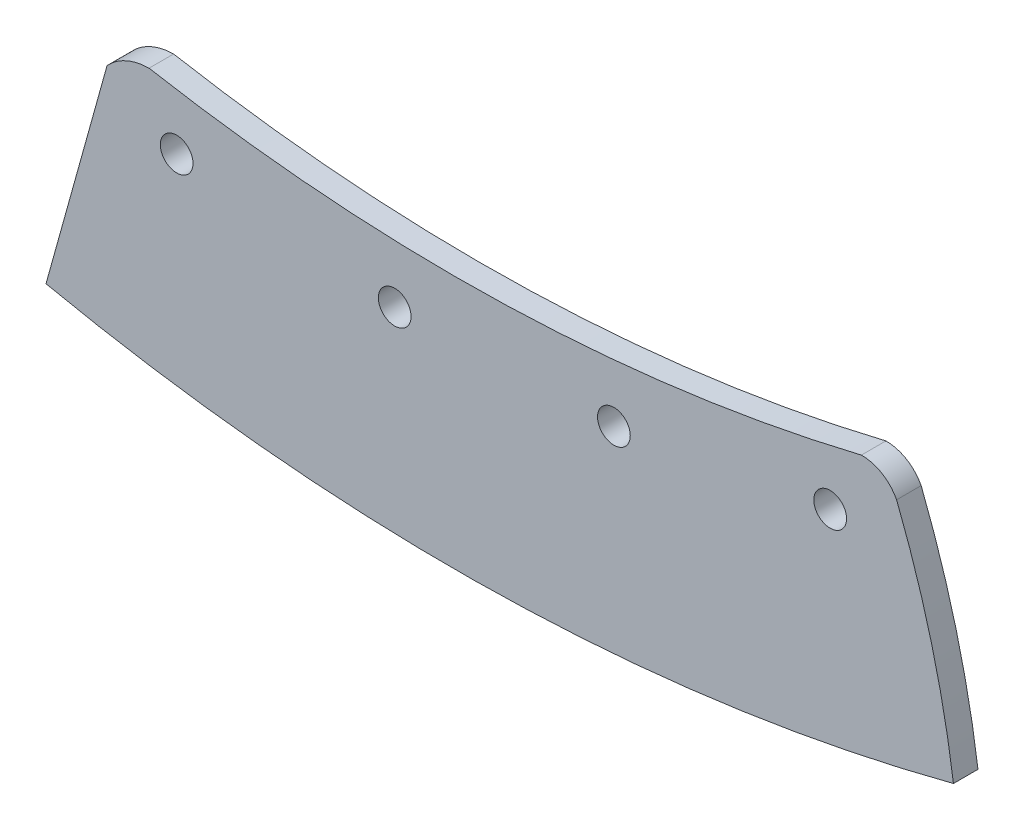
ISO-10303-21;
HEADER;
FILE_DESCRIPTION(('STEP AP214'),'2;1');
FILE_NAME('part.step','',(''),(''),'','','');
FILE_SCHEMA(('AUTOMOTIVE_DESIGN { 1 0 10303 214 1 1 1 1 }'));
ENDSEC;
DATA;
#1=APPLICATION_CONTEXT('core data for automotive mechanical design processes');
#2=APPLICATION_PROTOCOL_DEFINITION('international standard','automotive_design',2000,#1);
#3=PRODUCT_CONTEXT('',#1,'mechanical');
#4=PRODUCT('Part','Part','',(#3));
#5=PRODUCT_RELATED_PRODUCT_CATEGORY('part','',(#4));
#6=PRODUCT_DEFINITION_FORMATION('','',#4);
#7=PRODUCT_DEFINITION_CONTEXT('part definition',#1,'design');
#8=PRODUCT_DEFINITION('design','',#6,#7);
#9=PRODUCT_DEFINITION_SHAPE('','',#8);
#10=(LENGTH_UNIT() NAMED_UNIT(*) SI_UNIT(.MILLI.,.METRE.));
#11=(NAMED_UNIT(*) PLANE_ANGLE_UNIT() SI_UNIT($,.RADIAN.));
#12=(NAMED_UNIT(*) SI_UNIT($,.STERADIAN.) SOLID_ANGLE_UNIT());
#13=UNCERTAINTY_MEASURE_WITH_UNIT(LENGTH_MEASURE(1.E-05),#10,'distance_accuracy_value','');
#14=(GEOMETRIC_REPRESENTATION_CONTEXT(3) GLOBAL_UNCERTAINTY_ASSIGNED_CONTEXT((#13)) GLOBAL_UNIT_ASSIGNED_CONTEXT((#10,
#11,#12)) REPRESENTATION_CONTEXT('',''));
#15=CARTESIAN_POINT('',(0.,0.,0.));
#16=DIRECTION('',(0.,0.,1.));
#17=DIRECTION('',(1.,0.,0.));
#18=AXIS2_PLACEMENT_3D('',#15,#16,#17);
#19=CARTESIAN_POINT('',(-128.670594130339,132.9550895011,-15.));
#20=DIRECTION('',(0.,0.,1.));
#21=DIRECTION('',(1.,0.,0.));
#22=AXIS2_PLACEMENT_3D('',#19,#20,#21);
#23=CYLINDRICAL_SURFACE('',#22,35.3381718131456);
#24=CARTESIAN_POINT('',(-128.670594130339,132.9550895011,0.));
#25=DIRECTION('',(0.,0.,1.));
#26=DIRECTION('',(-1.,0.,0.));
#27=AXIS2_PLACEMENT_3D('',#24,#25,#26);
#28=CIRCLE('',#27,35.3381718131456);
#29=CARTESIAN_POINT('',(-129.053786306258,168.291183666298,0.));
#30=VERTEX_POINT('',#29);
#31=CARTESIAN_POINT('',(-154.698643159347,156.857538137986,0.));
#32=VERTEX_POINT('',#31);
#33=EDGE_CURVE('E123',#30,#32,#28,.T.);
#34=ORIENTED_EDGE('',*,*,#33,.F.);
#35=DIRECTION('',(0.,0.,1.));
#36=VECTOR('',#35,1.);
#37=CARTESIAN_POINT('',(-129.053786306258,168.291183666298,-15.));
#38=LINE('',#37,#36);
#39=CARTESIAN_POINT('',(-129.053786306258,168.291183666298,-15.));
#40=VERTEX_POINT('',#39);
#41=EDGE_CURVE('E11',#40,#30,#38,.T.);
#42=ORIENTED_EDGE('',*,*,#41,.F.);
#43=CARTESIAN_POINT('',(-128.670594130339,132.9550895011,-15.));
#44=DIRECTION('',(0.,0.,1.));
#45=DIRECTION('',(-1.,0.,0.));
#46=AXIS2_PLACEMENT_3D('',#43,#44,#45);
#47=CIRCLE('',#46,35.3381718131456);
#48=CARTESIAN_POINT('',(-154.698643159347,156.857538137986,-15.));
#49=VERTEX_POINT('',#48);
#50=EDGE_CURVE('E138',#40,#49,#47,.T.);
#51=ORIENTED_EDGE('',*,*,#50,.T.);
#52=DIRECTION('',(0.,0.,1.));
#53=VECTOR('',#52,1.);
#54=CARTESIAN_POINT('',(-154.698643159347,156.857538137986,-15.));
#55=LINE('',#54,#53);
#56=EDGE_CURVE('E41',#49,#32,#55,.T.);
#57=ORIENTED_EDGE('',*,*,#56,.T.);
#58=EDGE_LOOP('',(#34,#42,#51,#57));
#59=FACE_BOUND('',#58,.T.);
#60=ADVANCED_FACE('F38',(#59),#23,.T.);
#61=CARTESIAN_POINT('',(58.1264232533266,1203.86531314464,-15.));
#62=DIRECTION('',(0.,0.,1.));
#63=DIRECTION('',(1.,0.,0.));
#64=AXIS2_PLACEMENT_3D('',#61,#62,#63);
#65=CYLINDRICAL_SURFACE('',#64,1052.3546020689);
#66=CARTESIAN_POINT('',(58.1264232533266,1203.86531314464,0.));
#67=DIRECTION('',(0.,0.,-1.));
#68=DIRECTION('',(1.,0.,0.));
#69=AXIS2_PLACEMENT_3D('',#66,#67,#68);
#70=CIRCLE('',#69,1052.3546020689);
#71=CARTESIAN_POINT('',(306.201680974536,181.168449454254,0.));
#72=VERTEX_POINT('',#71);
#73=EDGE_CURVE('E136',#72,#30,#70,.T.);
#74=ORIENTED_EDGE('',*,*,#73,.F.);
#75=DIRECTION('',(0.,0.,1.));
#76=VECTOR('',#75,1.);
#77=CARTESIAN_POINT('',(306.201680974536,181.168449454254,-15.));
#78=LINE('',#77,#76);
#79=CARTESIAN_POINT('',(306.201680974536,181.168449454254,-15.));
#80=VERTEX_POINT('',#79);
#81=EDGE_CURVE('E47',#80,#72,#78,.T.);
#82=ORIENTED_EDGE('',*,*,#81,.F.);
#83=CARTESIAN_POINT('',(58.1264232533266,1203.86531314464,-15.));
#84=DIRECTION('',(0.,0.,-1.));
#85=DIRECTION('',(1.,0.,0.));
#86=AXIS2_PLACEMENT_3D('',#83,#84,#85);
#87=CIRCLE('',#86,1052.3546020689);
#88=EDGE_CURVE('E113',#80,#40,#87,.T.);
#89=ORIENTED_EDGE('',*,*,#88,.T.);
#90=ORIENTED_EDGE('',*,*,#41,.T.);
#91=EDGE_LOOP('',(#74,#82,#89,#90));
#92=FACE_BOUND('',#91,.T.);
#93=ADVANCED_FACE('F146',(#92),#65,.F.);
#94=CARTESIAN_POINT('',(306.434619836102,157.11012145898,-15.));
#95=DIRECTION('',(0.,0.,1.));
#96=DIRECTION('',(1.,0.,0.));
#97=AXIS2_PLACEMENT_3D('',#94,#95,#96);
#98=CYLINDRICAL_SURFACE('',#97,24.0594556555514);
#99=CARTESIAN_POINT('',(306.434619836102,157.11012145898,0.));
#100=DIRECTION('',(0.,0.,1.));
#101=DIRECTION('',(-1.,0.,0.));
#102=AXIS2_PLACEMENT_3D('',#99,#100,#101);
#103=CIRCLE('',#102,24.0594556555514);
#104=CARTESIAN_POINT('',(327.738170111996,168.291183666298,0.));
#105=VERTEX_POINT('',#104);
#106=EDGE_CURVE('E100',#105,#72,#103,.T.);
#107=ORIENTED_EDGE('',*,*,#106,.F.);
#108=DIRECTION('',(0.,0.,1.));
#109=VECTOR('',#108,1.);
#110=CARTESIAN_POINT('',(327.738170111996,168.291183666298,-15.));
#111=LINE('',#110,#109);
#112=CARTESIAN_POINT('',(327.738170111996,168.291183666298,-15.));
#113=VERTEX_POINT('',#112);
#114=EDGE_CURVE('E95',#113,#105,#111,.T.);
#115=ORIENTED_EDGE('',*,*,#114,.F.);
#116=CARTESIAN_POINT('',(306.434619836102,157.11012145898,-15.));
#117=DIRECTION('',(0.,0.,1.));
#118=DIRECTION('',(-1.,0.,0.));
#119=AXIS2_PLACEMENT_3D('',#116,#117,#118);
#120=CIRCLE('',#119,24.0594556555514);
#121=EDGE_CURVE('E98',#113,#80,#120,.T.);
#122=ORIENTED_EDGE('',*,*,#121,.T.);
#123=ORIENTED_EDGE('',*,*,#81,.T.);
#124=EDGE_LOOP('',(#107,#115,#122,#123));
#125=FACE_BOUND('',#124,.T.);
#126=ADVANCED_FACE('F97',(#125),#98,.T.);
#127=CARTESIAN_POINT('',(-205.255081348269,-42.0298378815808,-15.));
#128=DIRECTION('',(0.,0.,1.));
#129=DIRECTION('',(1.,0.,0.));
#130=AXIS2_PLACEMENT_3D('',#127,#128,#129);
#131=CYLINDRICAL_SURFACE('',#130,572.989300255361);
#132=CARTESIAN_POINT('',(-205.255081348269,-42.0298378815808,0.));
#133=DIRECTION('',(0.,0.,1.));
#134=DIRECTION('',(-1.,0.,0.));
#135=AXIS2_PLACEMENT_3D('',#132,#133,#134);
#136=CIRCLE('',#135,572.989300255361);
#137=CARTESIAN_POINT('',(362.465125285996,35.4976100725183,0.));
#138=VERTEX_POINT('',#137);
#139=EDGE_CURVE('E133',#138,#105,#136,.T.);
#140=ORIENTED_EDGE('',*,*,#139,.F.);
#141=DIRECTION('',(0.,0.,1.));
#142=VECTOR('',#141,1.);
#143=CARTESIAN_POINT('',(362.465125285996,35.4976100725183,-15.));
#144=LINE('',#143,#142);
#145=CARTESIAN_POINT('',(362.465125285996,35.4976100725183,-15.));
#146=VERTEX_POINT('',#145);
#147=EDGE_CURVE('E105',#146,#138,#144,.T.);
#148=ORIENTED_EDGE('',*,*,#147,.F.);
#149=CARTESIAN_POINT('',(-205.255081348269,-42.0298378815808,-15.));
#150=DIRECTION('',(0.,0.,1.));
#151=DIRECTION('',(-1.,0.,0.));
#152=AXIS2_PLACEMENT_3D('',#149,#150,#151);
#153=CIRCLE('',#152,572.989300255361);
#154=EDGE_CURVE('E111',#146,#113,#153,.T.);
#155=ORIENTED_EDGE('',*,*,#154,.T.);
#156=ORIENTED_EDGE('',*,*,#114,.T.);
#157=EDGE_LOOP('',(#140,#148,#155,#156));
#158=FACE_BOUND('',#157,.T.);
#159=ADVANCED_FACE('F115',(#158),#131,.T.);
#160=CARTESIAN_POINT('',(58.1264232533266,1203.86531314464,-15.));
#161=DIRECTION('',(0.,0.,1.));
#162=DIRECTION('',(1.,0.,0.));
#163=AXIS2_PLACEMENT_3D('',#160,#161,#162);
#164=CYLINDRICAL_SURFACE('',#163,1207.3546020689);
#165=CARTESIAN_POINT('',(58.1264232533266,1203.86531314464,0.));
#166=DIRECTION('',(0.,0.,1.));
#167=DIRECTION('',(1.,0.,0.));
#168=AXIS2_PLACEMENT_3D('',#165,#166,#167);
#169=CIRCLE('',#168,1207.3546020689);
#170=CARTESIAN_POINT('',(-192.02497498638,22.7093483814447,0.));
#171=VERTEX_POINT('',#170);
#172=EDGE_CURVE('E130',#171,#138,#169,.T.);
#173=ORIENTED_EDGE('',*,*,#172,.F.);
#174=DIRECTION('',(0.,0.,1.));
#175=VECTOR('',#174,1.);
#176=CARTESIAN_POINT('',(-192.02497498638,22.7093483814447,-15.));
#177=LINE('',#176,#175);
#178=CARTESIAN_POINT('',(-192.02497498638,22.7093483814447,-15.));
#179=VERTEX_POINT('',#178);
#180=EDGE_CURVE('E141',#179,#171,#177,.T.);
#181=ORIENTED_EDGE('',*,*,#180,.F.);
#182=CARTESIAN_POINT('',(58.1264232533266,1203.86531314464,-15.));
#183=DIRECTION('',(0.,0.,1.));
#184=DIRECTION('',(1.,0.,0.));
#185=AXIS2_PLACEMENT_3D('',#182,#183,#184);
#186=CIRCLE('',#185,1207.3546020689);
#187=EDGE_CURVE('E116',#179,#146,#186,.T.);
#188=ORIENTED_EDGE('',*,*,#187,.T.);
#189=ORIENTED_EDGE('',*,*,#147,.T.);
#190=EDGE_LOOP('',(#173,#181,#188,#189));
#191=FACE_BOUND('',#190,.T.);
#192=ADVANCED_FACE('F159',(#191),#164,.T.);
#193=CARTESIAN_POINT('',(-154.698643159347,156.857538137986,-15.));
#194=DIRECTION('',(-0.963401243049161,0.268063509063301,0.));
#195=DIRECTION('',(-0.268063509063301,-0.963401243049161,0.));
#196=AXIS2_PLACEMENT_3D('',#193,#194,#195);
#197=PLANE('',#196);
#198=DIRECTION('',(-0.268063509063301,-0.963401243049161,0.));
#199=VECTOR('',#198,1.);
#200=CARTESIAN_POINT('',(-154.698643159347,156.857538137986,0.));
#201=LINE('',#200,#199);
#202=EDGE_CURVE('E126',#32,#171,#201,.T.);
#203=ORIENTED_EDGE('',*,*,#202,.F.);
#204=ORIENTED_EDGE('',*,*,#56,.F.);
#205=DIRECTION('',(-0.268063509063301,-0.963401243049161,0.));
#206=VECTOR('',#205,1.);
#207=CARTESIAN_POINT('',(-154.698643159347,156.857538137986,-15.));
#208=LINE('',#207,#206);
#209=EDGE_CURVE('E118',#49,#179,#208,.T.);
#210=ORIENTED_EDGE('',*,*,#209,.T.);
#211=ORIENTED_EDGE('',*,*,#180,.T.);
#212=EDGE_LOOP('',(#203,#204,#210,#211));
#213=FACE_BOUND('',#212,.T.);
#214=ADVANCED_FACE('F143',(#213),#197,.T.);
#215=CARTESIAN_POINT('',(-128.670594130339,132.9550895011,-15.));
#216=DIRECTION('',(0.,0.,-1.));
#217=DIRECTION('',(-1.,0.,0.));
#218=AXIS2_PLACEMENT_3D('',#215,#216,#217);
#219=PLANE('',#218);
#220=CARTESIAN_POINT('',(287.14051374508,142.950022082553,-15.));
#221=DIRECTION('',(0.,0.,1.));
#222=DIRECTION('',(1.,0.,0.));
#223=AXIS2_PLACEMENT_3D('',#220,#221,#222);
#224=CIRCLE('',#223,10.);
#225=CARTESIAN_POINT('',(297.14051374508,142.950022082553,-15.));
#226=VERTEX_POINT('',#225);
#227=EDGE_CURVE('E193',#226,#226,#224,.T.);
#228=ORIENTED_EDGE('',*,*,#227,.T.);
#229=EDGE_LOOP('',(#228));
#230=FACE_BOUND('',#229,.T.);
#231=CARTESIAN_POINT('',(21.0409973056656,116.885172220673,-15.));
#232=DIRECTION('',(0.,0.,1.));
#233=DIRECTION('',(1.,0.,0.));
#234=AXIS2_PLACEMENT_3D('',#231,#232,#233);
#235=CIRCLE('',#234,10.);
#236=CARTESIAN_POINT('',(31.0409973056656,116.885172220673,-15.));
#237=VERTEX_POINT('',#236);
#238=EDGE_CURVE('E201',#237,#237,#235,.T.);
#239=ORIENTED_EDGE('',*,*,#238,.T.);
#240=EDGE_LOOP('',(#239));
#241=FACE_BOUND('',#240,.T.);
#242=CARTESIAN_POINT('',(154.983782421917,120.800566875315,-15.));
#243=DIRECTION('',(0.,0.,1.));
#244=DIRECTION('',(1.,0.,0.));
#245=AXIS2_PLACEMENT_3D('',#242,#243,#244);
#246=CIRCLE('',#245,10.);
#247=CARTESIAN_POINT('',(164.983782421917,120.800566875315,-15.));
#248=VERTEX_POINT('',#247);
#249=EDGE_CURVE('E207',#248,#248,#246,.T.);
#250=ORIENTED_EDGE('',*,*,#249,.T.);
#251=EDGE_LOOP('',(#250));
#252=FACE_BOUND('',#251,.T.);
#253=CARTESIAN_POINT('',(-112.183904076085,131.277032830853,-15.));
#254=DIRECTION('',(0.,0.,1.));
#255=DIRECTION('',(1.,0.,0.));
#256=AXIS2_PLACEMENT_3D('',#253,#254,#255);
#257=CIRCLE('',#256,10.);
#258=CARTESIAN_POINT('',(-102.183904076085,131.277032830853,-15.));
#259=VERTEX_POINT('',#258);
#260=EDGE_CURVE('E127',#259,#259,#257,.T.);
#261=ORIENTED_EDGE('',*,*,#260,.T.);
#262=EDGE_LOOP('',(#261));
#263=FACE_BOUND('',#262,.T.);
#264=ORIENTED_EDGE('',*,*,#50,.F.);
#265=ORIENTED_EDGE('',*,*,#88,.F.);
#266=ORIENTED_EDGE('',*,*,#121,.F.);
#267=ORIENTED_EDGE('',*,*,#154,.F.);
#268=ORIENTED_EDGE('',*,*,#187,.F.);
#269=ORIENTED_EDGE('',*,*,#209,.F.);
#270=EDGE_LOOP('',(#264,#265,#266,#267,#268,#269));
#271=FACE_BOUND('',#270,.T.);
#272=ADVANCED_FACE('F109',(#230,#241,#252,#263,#271),#219,.T.);
#273=CARTESIAN_POINT('',(-128.670594130339,132.9550895011,0.));
#274=DIRECTION('',(0.,0.,-1.));
#275=DIRECTION('',(-1.,0.,0.));
#276=AXIS2_PLACEMENT_3D('',#273,#274,#275);
#277=PLANE('',#276);
#278=CARTESIAN_POINT('',(287.14051374508,142.950022082553,0.));
#279=DIRECTION('',(0.,0.,1.));
#280=DIRECTION('',(1.,0.,0.));
#281=AXIS2_PLACEMENT_3D('',#278,#279,#280);
#282=CIRCLE('',#281,10.);
#283=CARTESIAN_POINT('',(297.14051374508,142.950022082553,0.));
#284=VERTEX_POINT('',#283);
#285=EDGE_CURVE('E196',#284,#284,#282,.T.);
#286=ORIENTED_EDGE('',*,*,#285,.F.);
#287=EDGE_LOOP('',(#286));
#288=FACE_BOUND('',#287,.T.);
#289=CARTESIAN_POINT('',(21.0409973056656,116.885172220673,0.));
#290=DIRECTION('',(0.,0.,1.));
#291=DIRECTION('',(1.,0.,0.));
#292=AXIS2_PLACEMENT_3D('',#289,#290,#291);
#293=CIRCLE('',#292,10.);
#294=CARTESIAN_POINT('',(31.0409973056656,116.885172220673,0.));
#295=VERTEX_POINT('',#294);
#296=EDGE_CURVE('E198',#295,#295,#293,.T.);
#297=ORIENTED_EDGE('',*,*,#296,.F.);
#298=EDGE_LOOP('',(#297));
#299=FACE_BOUND('',#298,.T.);
#300=CARTESIAN_POINT('',(154.983782421917,120.800566875315,0.));
#301=DIRECTION('',(0.,0.,1.));
#302=DIRECTION('',(1.,0.,0.));
#303=AXIS2_PLACEMENT_3D('',#300,#301,#302);
#304=CIRCLE('',#303,10.);
#305=CARTESIAN_POINT('',(164.983782421917,120.800566875315,0.));
#306=VERTEX_POINT('',#305);
#307=EDGE_CURVE('E204',#306,#306,#304,.T.);
#308=ORIENTED_EDGE('',*,*,#307,.F.);
#309=EDGE_LOOP('',(#308));
#310=FACE_BOUND('',#309,.T.);
#311=CARTESIAN_POINT('',(-112.183904076085,131.277032830853,0.));
#312=DIRECTION('',(0.,0.,1.));
#313=DIRECTION('',(1.,0.,0.));
#314=AXIS2_PLACEMENT_3D('',#311,#312,#313);
#315=CIRCLE('',#314,10.);
#316=CARTESIAN_POINT('',(-102.183904076085,131.277032830853,0.));
#317=VERTEX_POINT('',#316);
#318=EDGE_CURVE('E210',#317,#317,#315,.T.);
#319=ORIENTED_EDGE('',*,*,#318,.F.);
#320=EDGE_LOOP('',(#319));
#321=FACE_BOUND('',#320,.T.);
#322=ORIENTED_EDGE('',*,*,#33,.T.);
#323=ORIENTED_EDGE('',*,*,#202,.T.);
#324=ORIENTED_EDGE('',*,*,#172,.T.);
#325=ORIENTED_EDGE('',*,*,#139,.T.);
#326=ORIENTED_EDGE('',*,*,#106,.T.);
#327=ORIENTED_EDGE('',*,*,#73,.T.);
#328=EDGE_LOOP('',(#322,#323,#324,#325,#326,#327));
#329=FACE_BOUND('',#328,.T.);
#330=ADVANCED_FACE('F145',(#288,#299,#310,#321,#329),#277,.F.);
#331=CARTESIAN_POINT('',(-112.183904076085,131.277032830853,-15.));
#332=DIRECTION('',(0.,0.,1.));
#333=DIRECTION('',(1.,0.,0.));
#334=AXIS2_PLACEMENT_3D('',#331,#332,#333);
#335=CYLINDRICAL_SURFACE('',#334,10.);
#336=ORIENTED_EDGE('',*,*,#260,.F.);
#337=EDGE_LOOP('',(#336));
#338=FACE_BOUND('',#337,.T.);
#339=ORIENTED_EDGE('',*,*,#318,.T.);
#340=EDGE_LOOP('',(#339));
#341=FACE_BOUND('',#340,.T.);
#342=ADVANCED_FACE('F170',(#338,#341),#335,.F.);
#343=CARTESIAN_POINT('',(154.983782421917,120.800566875315,-15.));
#344=DIRECTION('',(0.,0.,1.));
#345=DIRECTION('',(1.,0.,0.));
#346=AXIS2_PLACEMENT_3D('',#343,#344,#345);
#347=CYLINDRICAL_SURFACE('',#346,10.);
#348=ORIENTED_EDGE('',*,*,#249,.F.);
#349=EDGE_LOOP('',(#348));
#350=FACE_BOUND('',#349,.T.);
#351=ORIENTED_EDGE('',*,*,#307,.T.);
#352=EDGE_LOOP('',(#351));
#353=FACE_BOUND('',#352,.T.);
#354=ADVANCED_FACE('F177',(#350,#353),#347,.F.);
#355=CARTESIAN_POINT('',(21.0409973056656,116.885172220673,-15.));
#356=DIRECTION('',(0.,0.,1.));
#357=DIRECTION('',(1.,0.,0.));
#358=AXIS2_PLACEMENT_3D('',#355,#356,#357);
#359=CYLINDRICAL_SURFACE('',#358,10.);
#360=ORIENTED_EDGE('',*,*,#238,.F.);
#361=EDGE_LOOP('',(#360));
#362=FACE_BOUND('',#361,.T.);
#363=ORIENTED_EDGE('',*,*,#296,.T.);
#364=EDGE_LOOP('',(#363));
#365=FACE_BOUND('',#364,.T.);
#366=ADVANCED_FACE('F181',(#362,#365),#359,.F.);
#367=CARTESIAN_POINT('',(287.14051374508,142.950022082553,-15.));
#368=DIRECTION('',(0.,0.,1.));
#369=DIRECTION('',(1.,0.,0.));
#370=AXIS2_PLACEMENT_3D('',#367,#368,#369);
#371=CYLINDRICAL_SURFACE('',#370,10.);
#372=ORIENTED_EDGE('',*,*,#227,.F.);
#373=EDGE_LOOP('',(#372));
#374=FACE_BOUND('',#373,.T.);
#375=ORIENTED_EDGE('',*,*,#285,.T.);
#376=EDGE_LOOP('',(#375));
#377=FACE_BOUND('',#376,.T.);
#378=ADVANCED_FACE('F185',(#374,#377),#371,.F.);
#379=CLOSED_SHELL('',(#60,#93,#126,#159,#192,#214,#272,#330,#342,#354,#366,#378));
#380=MANIFOLD_SOLID_BREP('B2',#379);
#381=ADVANCED_BREP_SHAPE_REPRESENTATION('',(#18,#380),#14);
#382=SHAPE_DEFINITION_REPRESENTATION(#9,#381);
ENDSEC;
END-ISO-10303-21;
